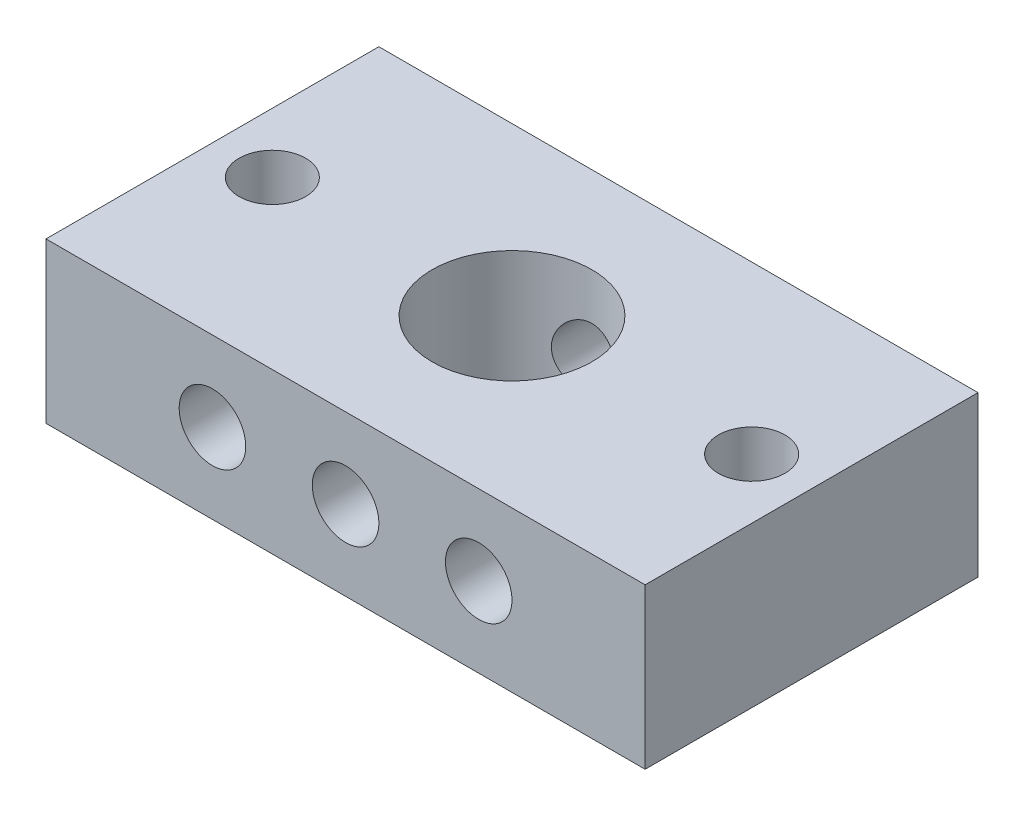
ISO-10303-21;
HEADER;
FILE_DESCRIPTION(('STEP AP214'),'2;1');
FILE_NAME('part.step','',(''),(''),'','','');
FILE_SCHEMA(('AUTOMOTIVE_DESIGN { 1 0 10303 214 1 1 1 1 }'));
ENDSEC;
DATA;
#1=APPLICATION_CONTEXT('core data for automotive mechanical design processes');
#2=APPLICATION_PROTOCOL_DEFINITION('international standard','automotive_design',2000,#1);
#3=PRODUCT_CONTEXT('',#1,'mechanical');
#4=PRODUCT('Part','Part','',(#3));
#5=PRODUCT_RELATED_PRODUCT_CATEGORY('part','',(#4));
#6=PRODUCT_DEFINITION_FORMATION('','',#4);
#7=PRODUCT_DEFINITION_CONTEXT('part definition',#1,'design');
#8=PRODUCT_DEFINITION('design','',#6,#7);
#9=PRODUCT_DEFINITION_SHAPE('','',#8);
#10=(LENGTH_UNIT() NAMED_UNIT(*) SI_UNIT(.MILLI.,.METRE.));
#11=(NAMED_UNIT(*) PLANE_ANGLE_UNIT() SI_UNIT($,.RADIAN.));
#12=(NAMED_UNIT(*) SI_UNIT($,.STERADIAN.) SOLID_ANGLE_UNIT());
#13=UNCERTAINTY_MEASURE_WITH_UNIT(LENGTH_MEASURE(1.E-05),#10,'distance_accuracy_value','');
#14=(GEOMETRIC_REPRESENTATION_CONTEXT(3) GLOBAL_UNCERTAINTY_ASSIGNED_CONTEXT((#13)) GLOBAL_UNIT_ASSIGNED_CONTEXT((#10,
#11,#12)) REPRESENTATION_CONTEXT('',''));
#15=CARTESIAN_POINT('',(0.,0.,0.));
#16=DIRECTION('',(0.,0.,1.));
#17=DIRECTION('',(1.,0.,0.));
#18=AXIS2_PLACEMENT_3D('',#15,#16,#17);
#19=CARTESIAN_POINT('',(0.,6.,59.5));
#20=DIRECTION('',(0.,0.,-1.));
#21=DIRECTION('',(-1.,0.,0.));
#22=AXIS2_PLACEMENT_3D('',#19,#20,#21);
#23=CYLINDRICAL_SURFACE('',#22,2.5);
#24=CARTESIAN_POINT('',(-2.5,6.,5.45435605731786));
#25=CARTESIAN_POINT('',(-2.49999850025921,6.0667081831549,5.45435734054166));
#26=CARTESIAN_POINT('',(-2.49732449538893,6.13343479216854,5.4555854329));
#27=CARTESIAN_POINT('',(-2.48666416485593,6.26638647840299,5.460451257595));
#28=CARTESIAN_POINT('',(-2.47867468210214,6.3326112338951,5.46409042196574));
#29=CARTESIAN_POINT('',(-2.44679265931592,6.53005186677056,5.47848490817198));
#30=CARTESIAN_POINT('',(-2.41498683408238,6.65983681642949,5.49271671920564));
#31=CARTESIAN_POINT('',(-2.33180001337599,6.91115476413125,5.52853615769555));
#32=CARTESIAN_POINT('',(-2.28049881438598,7.03271905209161,5.55009376241033));
#33=CARTESIAN_POINT('',(-2.16001268934738,7.26551017655699,5.59808356001864));
#34=CARTESIAN_POINT('',(-2.09083199376537,7.37673944997679,5.62451459938574));
#35=CARTESIAN_POINT('',(-1.93194778443699,7.59265398208942,5.68111508149861));
#36=CARTESIAN_POINT('',(-1.84130648149063,7.69661579704746,5.71141131571832));
#37=CARTESIAN_POINT('',(-1.64404334636732,7.88839976517447,5.77128595332677));
#38=CARTESIAN_POINT('',(-1.53741538134828,7.97621569551115,5.80086407614999));
#39=CARTESIAN_POINT('',(-1.30552678905513,8.13689925552864,5.8575107455344));
#40=CARTESIAN_POINT('',(-1.17965858775786,8.20895330788146,5.88441479600862));
#41=CARTESIAN_POINT('',(-0.916264044334339,8.33055198921748,5.93113040336416));
#42=CARTESIAN_POINT('',(-0.778742909642265,8.38010661039742,5.95094510785638));
#43=CARTESIAN_POINT('',(-0.503536996147008,8.45267893034036,5.98035041998162));
#44=CARTESIAN_POINT('',(-0.36623315241801,8.47694339323322,5.99041942231785));
#45=CARTESIAN_POINT('',(-0.089158360704174,8.50227527889198,6.00093657245546));
#46=CARTESIAN_POINT('',(0.050611563535766,8.50335211087422,6.00138862268061));
#47=CARTESIAN_POINT('',(0.319585560218813,8.48293143897079,5.99290258260449));
#48=CARTESIAN_POINT('',(0.448914977212893,8.46280379917312,5.98453429295767));
#49=CARTESIAN_POINT('',(0.702165787864647,8.40289379449909,5.96013033502178));
#50=CARTESIAN_POINT('',(0.826086782110447,8.36310998067885,5.94409410149732));
#51=CARTESIAN_POINT('',(1.06727623615443,8.26454391827247,5.90559704827471));
#52=CARTESIAN_POINT('',(1.18441435414909,8.20548107427576,5.88304194251414));
#53=CARTESIAN_POINT('',(1.40742353456465,8.0703084865819,5.83371427980366));
#54=CARTESIAN_POINT('',(1.51329059551623,7.99419271830215,5.80694023334947));
#55=CARTESIAN_POINT('',(1.7186818234134,7.8208351591992,5.74963397551513));
#56=CARTESIAN_POINT('',(1.81723287462318,7.72248241745696,5.71896988702082));
#57=CARTESIAN_POINT('',(1.99686282986464,7.51057711857186,5.65875721372882));
#58=CARTESIAN_POINT('',(2.0779349916834,7.39701872336434,5.62920906299902));
#59=CARTESIAN_POINT('',(2.22280378497075,7.15320992672028,5.57363224672088));
#60=CARTESIAN_POINT('',(2.28594506698397,7.0225335886945,5.54775116967603));
#61=CARTESIAN_POINT('',(2.38892864103959,6.75103791023743,5.50419688296718));
#62=CARTESIAN_POINT('',(2.42878759251238,6.61022590351575,5.48651780631503));
#63=CARTESIAN_POINT('',(2.48160050339178,6.33220638213301,5.46282425074792));
#64=CARTESIAN_POINT('',(2.49613229266517,6.19535775547148,5.45612738403682));
#65=CARTESIAN_POINT('',(2.50251261037213,5.92104303518741,5.45320573611839));
#66=CARTESIAN_POINT('',(2.49436898636095,5.78357717161926,5.45697733196184));
#67=CARTESIAN_POINT('',(2.45706955131303,5.5212032291366,5.47386262693795));
#68=CARTESIAN_POINT('',(2.42929237636148,5.39605462642581,5.48636276033852));
#69=CARTESIAN_POINT('',(2.355341171284,5.15229740700485,5.51851260594277));
#70=CARTESIAN_POINT('',(2.30916284106237,5.03369032633843,5.53816398920152));
#71=CARTESIAN_POINT('',(2.19755041610386,4.80076937928722,5.58341595714177));
#72=CARTESIAN_POINT('',(2.13138366612393,4.68685005078064,5.60923324404617));
#73=CARTESIAN_POINT('',(1.98240156877197,4.47118389500067,5.66360007481535));
#74=CARTESIAN_POINT('',(1.89957901575222,4.36944236659127,5.69215079841133));
#75=CARTESIAN_POINT('',(1.71168891143074,4.17239973023739,5.75157239569101));
#76=CARTESIAN_POINT('',(1.6053593229584,4.07829720011966,5.78244293417774));
#77=CARTESIAN_POINT('',(1.37770302510816,3.90905541602037,5.84086722367755));
#78=CARTESIAN_POINT('',(1.25637521761135,3.8339175517941,5.868420731537));
#79=CARTESIAN_POINT('',(1.00130936160273,3.70482024919155,5.91728503171628));
#80=CARTESIAN_POINT('',(0.867540339261896,3.65091551771517,5.93857966278875));
#81=CARTESIAN_POINT('',(0.591717670323946,3.56676641503718,5.9723634620551));
#82=CARTESIAN_POINT('',(0.449669008506775,3.536507962451,5.98485787035282));
#83=CARTESIAN_POINT('',(0.172033066960383,3.50228374997958,5.9990306959926));
#84=CARTESIAN_POINT('',(0.0366881693984344,3.49662800428995,6.0014040908376));
#85=CARTESIAN_POINT('',(-0.232973623239238,3.50722627890465,5.99699046946599));
#86=CARTESIAN_POINT('',(-0.367290694377476,3.52347645831395,5.99020505911644));
#87=CARTESIAN_POINT('',(-0.626172965578197,3.5762121575427,5.9686013201843));
#88=CARTESIAN_POINT('',(-0.750915078182086,3.61195940947576,5.95407648620171));
#89=CARTESIAN_POINT('',(-0.992584458507238,3.70186844587238,5.91858999492374));
#90=CARTESIAN_POINT('',(-1.1095102366691,3.75603372835824,5.89762711496349));
#91=CARTESIAN_POINT('',(-1.33804914068053,3.88397924757924,5.85011651583377));
#92=CARTESIAN_POINT('',(-1.44918335299799,3.95853532351305,5.82335921372399));
#93=CARTESIAN_POINT('',(-1.65783731421916,4.12401364481073,5.7674312075248));
#94=CARTESIAN_POINT('',(-1.75535198504112,4.21494196583612,5.73825960968076));
#95=CARTESIAN_POINT('',(-1.9408997224229,4.41789253007209,5.67829702479813));
#96=CARTESIAN_POINT('',(-2.02783607699356,4.53092911202995,5.64753091772368));
#97=CARTESIAN_POINT('',(-2.18166607575475,4.77090639200073,5.5899105903639));
#98=CARTESIAN_POINT('',(-2.24854851583746,4.89785480866736,5.56305856115973));
#99=CARTESIAN_POINT('',(-2.35965744264203,5.16192893335946,5.51685287460303));
#100=CARTESIAN_POINT('',(-2.40400437258696,5.29899595514957,5.49745949216625));
#101=CARTESIAN_POINT('',(-2.45239925350778,5.50916376906638,5.47594959049764));
#102=CARTESIAN_POINT('',(-2.46550603347808,5.57991059795605,5.47004503557757));
#103=CARTESIAN_POINT('',(-2.48558130943928,5.72242605641858,5.46095373466209));
#104=CARTESIAN_POINT('',(-2.49255414024397,5.79419392792262,5.45776506941946));
#105=CARTESIAN_POINT('',(-2.49880479670823,5.91071160563903,5.45490391727668));
#106=CARTESIAN_POINT('',(-2.50000100378859,5.9553516756734,5.45435519844583));
#107=CARTESIAN_POINT('',(-2.5,6.,5.45435605731786));
#108=B_SPLINE_CURVE_WITH_KNOTS('',3,(#24,#25,#26,#27,#28,#29,#30,#31,#32,#33,#34,#35,#36,#37,
#38,#39,#40,#41,#42,#43,#44,#45,#46,#47,#48,#49,#50,#51,#52,#53,#54,#55,#56,#57,#58,#59,#60,#61,
#62,#63,#64,#65,#66,#67,#68,#69,#70,#71,#72,#73,#74,#75,#76,#77,#78,#79,#80,#81,#82,#83,#84,#85,
#86,#87,#88,#89,#90,#91,#92,#93,#94,#95,#96,#97,#98,#99,#100,#101,#102,#103,#104,#105,#106,
#107),.UNSPECIFIED.,.T.,.F.,(4,2,2,2,2,2,2,2,2,2,2,2,2,2,2,2,2,2,2,2,2,2,2,2,2,2,2,2,2,2,2,2,2,
2,2,2,2,2,2,2,2,4),(0.,0.200084575093046,0.400288095243582,0.801278994956904,1.20064597557678,
1.59991854837275,2.02172149988563,2.44368668047077,2.88395420283103,3.32402600677038,
3.7411967908316,4.15819828963116,4.54982147617441,4.94147353531023,5.33910096407387,
5.73686909172223,6.16267530816224,6.58864548009989,7.02861558463919,7.46827048625634,
7.87940023747111,8.29038772171394,8.6750626926688,9.05982760961556,9.46088720770835,
9.86212068725427,10.2960179260552,10.7299469521823,11.1649867904569,11.5997673642051,
12.004157373226,12.4084764873833,12.7984529720747,13.1885035639884,13.5961819279257,
14.0040118923231,14.4395932095167,14.8754174341574,15.3088871873109,15.5252058174741,
15.7413714538654,15.8752896716763),.UNSPECIFIED.);
#109=CARTESIAN_POINT('',(-2.5,6.,5.45435605731786));
#110=VERTEX_POINT('',#109);
#111=EDGE_CURVE('E127',#110,#110,#108,.T.);
#112=ORIENTED_EDGE('',*,*,#111,.T.);
#113=EDGE_LOOP('',(#112));
#114=FACE_BOUND('',#113,.T.);
#115=CARTESIAN_POINT('',(0.,6.,12.5));
#116=DIRECTION('',(0.,0.,-1.));
#117=DIRECTION('',(-1.,0.,0.));
#118=AXIS2_PLACEMENT_3D('',#115,#116,#117);
#119=CIRCLE('',#118,2.5);
#120=CARTESIAN_POINT('',(-2.5,6.,12.5));
#121=VERTEX_POINT('',#120);
#122=EDGE_CURVE('E103',#121,#121,#119,.T.);
#123=ORIENTED_EDGE('',*,*,#122,.F.);
#124=EDGE_LOOP('',(#123));
#125=FACE_BOUND('',#124,.T.);
#126=ADVANCED_FACE('F33',(#114,#125),#23,.F.);
#127=CARTESIAN_POINT('',(22.5,12.,-12.5));
#128=DIRECTION('',(-1.,0.,0.));
#129=DIRECTION('',(0.,0.,1.));
#130=AXIS2_PLACEMENT_3D('',#127,#128,#129);
#131=PLANE('',#130);
#132=DIRECTION('',(0.,0.,-1.));
#133=VECTOR('',#132,1.);
#134=CARTESIAN_POINT('',(22.5,0.,-12.5));
#135=LINE('',#134,#133);
#136=CARTESIAN_POINT('',(22.5,0.,12.5));
#137=VERTEX_POINT('',#136);
#138=CARTESIAN_POINT('',(22.5,0.,-12.5));
#139=VERTEX_POINT('',#138);
#140=EDGE_CURVE('E100',#137,#139,#135,.T.);
#141=ORIENTED_EDGE('',*,*,#140,.T.);
#142=DIRECTION('',(0.,-1.,0.));
#143=VECTOR('',#142,1.);
#144=CARTESIAN_POINT('',(22.5,12.,-12.5));
#145=LINE('',#144,#143);
#146=CARTESIAN_POINT('',(22.5,12.,-12.5));
#147=VERTEX_POINT('',#146);
#148=EDGE_CURVE('E11',#147,#139,#145,.T.);
#149=ORIENTED_EDGE('',*,*,#148,.F.);
#150=DIRECTION('',(0.,0.,-1.));
#151=VECTOR('',#150,1.);
#152=CARTESIAN_POINT('',(22.5,12.,-12.5));
#153=LINE('',#152,#151);
#154=CARTESIAN_POINT('',(22.5,12.,12.5));
#155=VERTEX_POINT('',#154);
#156=EDGE_CURVE('E87',#155,#147,#153,.T.);
#157=ORIENTED_EDGE('',*,*,#156,.F.);
#158=DIRECTION('',(0.,-1.,0.));
#159=VECTOR('',#158,1.);
#160=CARTESIAN_POINT('',(22.5,12.,12.5));
#161=LINE('',#160,#159);
#162=EDGE_CURVE('E96',#155,#137,#161,.T.);
#163=ORIENTED_EDGE('',*,*,#162,.T.);
#164=EDGE_LOOP('',(#141,#149,#157,#163));
#165=FACE_BOUND('',#164,.T.);
#166=ADVANCED_FACE('F35',(#165),#131,.F.);
#167=CARTESIAN_POINT('',(-22.5,12.,-12.5));
#168=DIRECTION('',(0.,0.,1.));
#169=DIRECTION('',(1.,0.,0.));
#170=AXIS2_PLACEMENT_3D('',#167,#168,#169);
#171=PLANE('',#170);
#172=CARTESIAN_POINT('',(-10.,6.,-12.5));
#173=DIRECTION('',(0.,0.,-1.));
#174=DIRECTION('',(-1.,0.,0.));
#175=AXIS2_PLACEMENT_3D('',#172,#173,#174);
#176=CIRCLE('',#175,2.5);
#177=CARTESIAN_POINT('',(-12.5,6.,-12.5));
#178=VERTEX_POINT('',#177);
#179=EDGE_CURVE('E116',#178,#178,#176,.T.);
#180=ORIENTED_EDGE('',*,*,#179,.F.);
#181=EDGE_LOOP('',(#180));
#182=FACE_BOUND('',#181,.T.);
#183=CARTESIAN_POINT('',(10.,6.,-12.5));
#184=DIRECTION('',(0.,0.,-1.));
#185=DIRECTION('',(-1.,0.,0.));
#186=AXIS2_PLACEMENT_3D('',#183,#184,#185);
#187=CIRCLE('',#186,2.5);
#188=CARTESIAN_POINT('',(7.5,6.,-12.5));
#189=VERTEX_POINT('',#188);
#190=EDGE_CURVE('E190',#189,#189,#187,.T.);
#191=ORIENTED_EDGE('',*,*,#190,.F.);
#192=EDGE_LOOP('',(#191));
#193=FACE_BOUND('',#192,.T.);
#194=CARTESIAN_POINT('',(0.,6.,-12.5));
#195=DIRECTION('',(0.,0.,-1.));
#196=DIRECTION('',(-1.,0.,0.));
#197=AXIS2_PLACEMENT_3D('',#194,#195,#196);
#198=CIRCLE('',#197,2.5);
#199=CARTESIAN_POINT('',(-2.5,6.,-12.5));
#200=VERTEX_POINT('',#199);
#201=EDGE_CURVE('E111',#200,#200,#198,.T.);
#202=ORIENTED_EDGE('',*,*,#201,.F.);
#203=EDGE_LOOP('',(#202));
#204=FACE_BOUND('',#203,.T.);
#205=DIRECTION('',(-1.,0.,0.));
#206=VECTOR('',#205,1.);
#207=CARTESIAN_POINT('',(-22.5,0.,-12.5));
#208=LINE('',#207,#206);
#209=CARTESIAN_POINT('',(-22.5,0.,-12.5));
#210=VERTEX_POINT('',#209);
#211=EDGE_CURVE('E91',#139,#210,#208,.T.);
#212=ORIENTED_EDGE('',*,*,#211,.T.);
#213=DIRECTION('',(0.,-1.,0.));
#214=VECTOR('',#213,1.);
#215=CARTESIAN_POINT('',(-22.5,12.,-12.5));
#216=LINE('',#215,#214);
#217=CARTESIAN_POINT('',(-22.5,12.,-12.5));
#218=VERTEX_POINT('',#217);
#219=EDGE_CURVE('E43',#218,#210,#216,.T.);
#220=ORIENTED_EDGE('',*,*,#219,.F.);
#221=DIRECTION('',(-1.,0.,0.));
#222=VECTOR('',#221,1.);
#223=CARTESIAN_POINT('',(-22.5,12.,-12.5));
#224=LINE('',#223,#222);
#225=EDGE_CURVE('E82',#147,#218,#224,.T.);
#226=ORIENTED_EDGE('',*,*,#225,.F.);
#227=ORIENTED_EDGE('',*,*,#148,.T.);
#228=EDGE_LOOP('',(#212,#220,#226,#227));
#229=FACE_BOUND('',#228,.T.);
#230=ADVANCED_FACE('F90',(#182,#193,#204,#229),#171,.F.);
#231=CARTESIAN_POINT('',(-22.5,12.,-12.5));
#232=DIRECTION('',(1.,0.,0.));
#233=DIRECTION('',(0.,0.,-1.));
#234=AXIS2_PLACEMENT_3D('',#231,#232,#233);
#235=PLANE('',#234);
#236=DIRECTION('',(0.,0.,1.));
#237=VECTOR('',#236,1.);
#238=CARTESIAN_POINT('',(-22.5,0.,-12.5));
#239=LINE('',#238,#237);
#240=CARTESIAN_POINT('',(-22.5,0.,12.5));
#241=VERTEX_POINT('',#240);
#242=EDGE_CURVE('E69',#210,#241,#239,.T.);
#243=ORIENTED_EDGE('',*,*,#242,.T.);
#244=DIRECTION('',(0.,-1.,0.));
#245=VECTOR('',#244,1.);
#246=CARTESIAN_POINT('',(-22.5,12.,12.5));
#247=LINE('',#246,#245);
#248=CARTESIAN_POINT('',(-22.5,12.,12.5));
#249=VERTEX_POINT('',#248);
#250=EDGE_CURVE('E92',#249,#241,#247,.T.);
#251=ORIENTED_EDGE('',*,*,#250,.F.);
#252=DIRECTION('',(0.,0.,1.));
#253=VECTOR('',#252,1.);
#254=CARTESIAN_POINT('',(-22.5,12.,-12.5));
#255=LINE('',#254,#253);
#256=EDGE_CURVE('E85',#218,#249,#255,.T.);
#257=ORIENTED_EDGE('',*,*,#256,.F.);
#258=ORIENTED_EDGE('',*,*,#219,.T.);
#259=EDGE_LOOP('',(#243,#251,#257,#258));
#260=FACE_BOUND('',#259,.T.);
#261=ADVANCED_FACE('F94',(#260),#235,.F.);
#262=CARTESIAN_POINT('',(-22.5,12.,12.5));
#263=DIRECTION('',(0.,0.,-1.));
#264=DIRECTION('',(-1.,0.,0.));
#265=AXIS2_PLACEMENT_3D('',#262,#263,#264);
#266=PLANE('',#265);
#267=CARTESIAN_POINT('',(-10.,6.,12.5));
#268=DIRECTION('',(0.,0.,-1.));
#269=DIRECTION('',(-1.,0.,0.));
#270=AXIS2_PLACEMENT_3D('',#267,#268,#269);
#271=CIRCLE('',#270,2.5);
#272=CARTESIAN_POINT('',(-12.5,6.,12.5));
#273=VERTEX_POINT('',#272);
#274=EDGE_CURVE('E115',#273,#273,#271,.T.);
#275=ORIENTED_EDGE('',*,*,#274,.T.);
#276=EDGE_LOOP('',(#275));
#277=FACE_BOUND('',#276,.T.);
#278=CARTESIAN_POINT('',(10.,6.,12.5));
#279=DIRECTION('',(0.,0.,-1.));
#280=DIRECTION('',(-1.,0.,0.));
#281=AXIS2_PLACEMENT_3D('',#278,#279,#280);
#282=CIRCLE('',#281,2.5);
#283=CARTESIAN_POINT('',(7.5,6.,12.5));
#284=VERTEX_POINT('',#283);
#285=EDGE_CURVE('E112',#284,#284,#282,.T.);
#286=ORIENTED_EDGE('',*,*,#285,.T.);
#287=EDGE_LOOP('',(#286));
#288=FACE_BOUND('',#287,.T.);
#289=ORIENTED_EDGE('',*,*,#122,.T.);
#290=EDGE_LOOP('',(#289));
#291=FACE_BOUND('',#290,.T.);
#292=DIRECTION('',(1.,0.,0.));
#293=VECTOR('',#292,1.);
#294=CARTESIAN_POINT('',(-22.5,0.,12.5));
#295=LINE('',#294,#293);
#296=EDGE_CURVE('E75',#241,#137,#295,.T.);
#297=ORIENTED_EDGE('',*,*,#296,.T.);
#298=ORIENTED_EDGE('',*,*,#162,.F.);
#299=DIRECTION('',(1.,0.,0.));
#300=VECTOR('',#299,1.);
#301=CARTESIAN_POINT('',(-22.5,12.,12.5));
#302=LINE('',#301,#300);
#303=EDGE_CURVE('E52',#249,#155,#302,.T.);
#304=ORIENTED_EDGE('',*,*,#303,.F.);
#305=ORIENTED_EDGE('',*,*,#250,.T.);
#306=EDGE_LOOP('',(#297,#298,#304,#305));
#307=FACE_BOUND('',#306,.T.);
#308=ADVANCED_FACE('F169',(#277,#288,#291,#307),#266,.F.);
#309=CARTESIAN_POINT('',(0.,12.,0.));
#310=DIRECTION('',(0.,1.,0.));
#311=DIRECTION('',(0.,0.,1.));
#312=AXIS2_PLACEMENT_3D('',#309,#310,#311);
#313=PLANE('',#312);
#314=CARTESIAN_POINT('',(-18.,12.,0.));
#315=DIRECTION('',(0.,1.,0.));
#316=DIRECTION('',(0.,0.,1.));
#317=AXIS2_PLACEMENT_3D('',#314,#315,#316);
#318=CIRCLE('',#317,2.5);
#319=CARTESIAN_POINT('',(-18.,12.,2.5));
#320=VERTEX_POINT('',#319);
#321=EDGE_CURVE('E206',#320,#320,#318,.T.);
#322=ORIENTED_EDGE('',*,*,#321,.F.);
#323=EDGE_LOOP('',(#322));
#324=FACE_BOUND('',#323,.T.);
#325=CARTESIAN_POINT('',(18.,12.,0.));
#326=DIRECTION('',(0.,1.,0.));
#327=DIRECTION('',(0.,0.,1.));
#328=AXIS2_PLACEMENT_3D('',#325,#326,#327);
#329=CIRCLE('',#328,2.5);
#330=CARTESIAN_POINT('',(18.,12.,2.5));
#331=VERTEX_POINT('',#330);
#332=EDGE_CURVE('E203',#331,#331,#329,.T.);
#333=ORIENTED_EDGE('',*,*,#332,.F.);
#334=EDGE_LOOP('',(#333));
#335=FACE_BOUND('',#334,.T.);
#336=CARTESIAN_POINT('',(0.,12.,0.));
#337=DIRECTION('',(0.,1.,0.));
#338=DIRECTION('',(0.,0.,1.));
#339=AXIS2_PLACEMENT_3D('',#336,#337,#338);
#340=CIRCLE('',#339,6.);
#341=CARTESIAN_POINT('',(0.,12.,6.));
#342=VERTEX_POINT('',#341);
#343=EDGE_CURVE('E128',#342,#342,#340,.T.);
#344=ORIENTED_EDGE('',*,*,#343,.F.);
#345=EDGE_LOOP('',(#344));
#346=FACE_BOUND('',#345,.T.);
#347=ORIENTED_EDGE('',*,*,#156,.T.);
#348=ORIENTED_EDGE('',*,*,#225,.T.);
#349=ORIENTED_EDGE('',*,*,#256,.T.);
#350=ORIENTED_EDGE('',*,*,#303,.T.);
#351=EDGE_LOOP('',(#347,#348,#349,#350));
#352=FACE_BOUND('',#351,.T.);
#353=ADVANCED_FACE('F83',(#324,#335,#346,#352),#313,.T.);
#354=CARTESIAN_POINT('',(0.,0.,0.));
#355=DIRECTION('',(0.,1.,0.));
#356=DIRECTION('',(0.,0.,1.));
#357=AXIS2_PLACEMENT_3D('',#354,#355,#356);
#358=PLANE('',#357);
#359=CARTESIAN_POINT('',(-18.,0.,0.));
#360=DIRECTION('',(0.,1.,0.));
#361=DIRECTION('',(0.,0.,1.));
#362=AXIS2_PLACEMENT_3D('',#359,#360,#361);
#363=CIRCLE('',#362,2.5);
#364=CARTESIAN_POINT('',(-18.,0.,2.5));
#365=VERTEX_POINT('',#364);
#366=EDGE_CURVE('E37',#365,#365,#363,.T.);
#367=ORIENTED_EDGE('',*,*,#366,.T.);
#368=EDGE_LOOP('',(#367));
#369=FACE_BOUND('',#368,.T.);
#370=CARTESIAN_POINT('',(18.,0.,0.));
#371=DIRECTION('',(0.,1.,0.));
#372=DIRECTION('',(0.,0.,1.));
#373=AXIS2_PLACEMENT_3D('',#370,#371,#372);
#374=CIRCLE('',#373,2.5);
#375=CARTESIAN_POINT('',(18.,0.,2.5));
#376=VERTEX_POINT('',#375);
#377=EDGE_CURVE('E208',#376,#376,#374,.T.);
#378=ORIENTED_EDGE('',*,*,#377,.T.);
#379=EDGE_LOOP('',(#378));
#380=FACE_BOUND('',#379,.T.);
#381=CARTESIAN_POINT('',(0.,0.,0.));
#382=DIRECTION('',(0.,1.,0.));
#383=DIRECTION('',(0.,0.,1.));
#384=AXIS2_PLACEMENT_3D('',#381,#382,#383);
#385=CIRCLE('',#384,6.);
#386=CARTESIAN_POINT('',(0.,0.,6.));
#387=VERTEX_POINT('',#386);
#388=EDGE_CURVE('E197',#387,#387,#385,.T.);
#389=ORIENTED_EDGE('',*,*,#388,.T.);
#390=EDGE_LOOP('',(#389));
#391=FACE_BOUND('',#390,.T.);
#392=ORIENTED_EDGE('',*,*,#140,.F.);
#393=ORIENTED_EDGE('',*,*,#296,.F.);
#394=ORIENTED_EDGE('',*,*,#242,.F.);
#395=ORIENTED_EDGE('',*,*,#211,.F.);
#396=EDGE_LOOP('',(#392,#393,#394,#395));
#397=FACE_BOUND('',#396,.T.);
#398=ADVANCED_FACE('F154',(#369,#380,#391,#397),#358,.F.);
#399=CARTESIAN_POINT('',(-2.5,6.,-5.45435605731786));
#400=CARTESIAN_POINT('',(-2.49999850025921,5.9332918168451,-5.45435734054166));
#401=CARTESIAN_POINT('',(-2.49732449538893,5.86656520783146,-5.4555854329));
#402=CARTESIAN_POINT('',(-2.48666416485593,5.73361352159701,-5.460451257595));
#403=CARTESIAN_POINT('',(-2.47867468210214,5.6673887661049,-5.46409042196574));
#404=CARTESIAN_POINT('',(-2.44679265931592,5.46994813322944,-5.47848490817198));
#405=CARTESIAN_POINT('',(-2.41498683408238,5.34016318357051,-5.49271671920564));
#406=CARTESIAN_POINT('',(-2.33180001337599,5.08884523586874,-5.52853615769555));
#407=CARTESIAN_POINT('',(-2.28049881438598,4.96728094790839,-5.55009376241033));
#408=CARTESIAN_POINT('',(-2.16001268934738,4.73448982344301,-5.59808356001865));
#409=CARTESIAN_POINT('',(-2.09083199376537,4.62326055002321,-5.62451459938574));
#410=CARTESIAN_POINT('',(-1.93194778443699,4.40734601791058,-5.68111508149861));
#411=CARTESIAN_POINT('',(-1.84130648149063,4.30338420295254,-5.71141131571833));
#412=CARTESIAN_POINT('',(-1.64404334636732,4.11160023482553,-5.77128595332677));
#413=CARTESIAN_POINT('',(-1.53741538134828,4.02378430448885,-5.80086407614999));
#414=CARTESIAN_POINT('',(-1.30552678905513,3.86310074447136,-5.8575107455344));
#415=CARTESIAN_POINT('',(-1.17965858775786,3.79104669211854,-5.88441479600862));
#416=CARTESIAN_POINT('',(-0.916264044334339,3.66944801078252,-5.93113040336416));
#417=CARTESIAN_POINT('',(-0.778742909642264,3.61989338960258,-5.95094510785638));
#418=CARTESIAN_POINT('',(-0.503536996147007,3.54732106965964,-5.98035041998162));
#419=CARTESIAN_POINT('',(-0.366233152418009,3.52305660676678,-5.99041942231785));
#420=CARTESIAN_POINT('',(-0.0891583607041735,3.49772472110802,-6.00093657245546));
#421=CARTESIAN_POINT('',(0.0506115635357663,3.49664788912577,-6.00138862268061));
#422=CARTESIAN_POINT('',(0.319585560218813,3.51706856102921,-5.99290258260449));
#423=CARTESIAN_POINT('',(0.448914977212893,3.53719620082688,-5.98453429295767));
#424=CARTESIAN_POINT('',(0.702165787864647,3.59710620550091,-5.96013033502178));
#425=CARTESIAN_POINT('',(0.826086782110447,3.63689001932115,-5.94409410149732));
#426=CARTESIAN_POINT('',(1.06727623615443,3.73545608172753,-5.90559704827471));
#427=CARTESIAN_POINT('',(1.18441435414909,3.79451892572424,-5.88304194251414));
#428=CARTESIAN_POINT('',(1.40742353456466,3.9296915134181,-5.83371427980366));
#429=CARTESIAN_POINT('',(1.51329059551624,4.00580728169785,-5.80694023334947));
#430=CARTESIAN_POINT('',(1.7186818234134,4.1791648408008,-5.74963397551513));
#431=CARTESIAN_POINT('',(1.81723287462318,4.27751758254304,-5.71896988702082));
#432=CARTESIAN_POINT('',(1.99686282986464,4.48942288142814,-5.65875721372882));
#433=CARTESIAN_POINT('',(2.0779349916834,4.60298127663566,-5.62920906299901));
#434=CARTESIAN_POINT('',(2.22280378497075,4.84679007327972,-5.57363224672088));
#435=CARTESIAN_POINT('',(2.28594506698397,4.9774664113055,-5.54775116967603));
#436=CARTESIAN_POINT('',(2.38892864103959,5.24896208976257,-5.50419688296718));
#437=CARTESIAN_POINT('',(2.42878759251237,5.38977409648425,-5.48651780631503));
#438=CARTESIAN_POINT('',(2.48160050339178,5.66779361786699,-5.46282425074792));
#439=CARTESIAN_POINT('',(2.49613229266517,5.80464224452852,-5.45612738403682));
#440=CARTESIAN_POINT('',(2.50251261037213,6.07895696481259,-5.45320573611839));
#441=CARTESIAN_POINT('',(2.49436898636095,6.21642282838074,-5.45697733196184));
#442=CARTESIAN_POINT('',(2.45706955131303,6.4787967708634,-5.47386262693795));
#443=CARTESIAN_POINT('',(2.42929237636148,6.60394537357419,-5.48636276033852));
#444=CARTESIAN_POINT('',(2.355341171284,6.84770259299515,-5.51851260594277));
#445=CARTESIAN_POINT('',(2.30916284106237,6.96630967366157,-5.53816398920152));
#446=CARTESIAN_POINT('',(2.19755041610386,7.19923062071278,-5.58341595714177));
#447=CARTESIAN_POINT('',(2.13138366612393,7.31314994921936,-5.60923324404617));
#448=CARTESIAN_POINT('',(1.98240156877197,7.52881610499933,-5.66360007481535));
#449=CARTESIAN_POINT('',(1.89957901575222,7.63055763340873,-5.69215079841133));
#450=CARTESIAN_POINT('',(1.71168891143075,7.82760026976261,-5.75157239569101));
#451=CARTESIAN_POINT('',(1.6053593229584,7.92170279988034,-5.78244293417774));
#452=CARTESIAN_POINT('',(1.37770302510816,8.09094458397963,-5.84086722367755));
#453=CARTESIAN_POINT('',(1.25637521761135,8.1660824482059,-5.868420731537));
#454=CARTESIAN_POINT('',(1.00130936160273,8.29517975080845,-5.91728503171628));
#455=CARTESIAN_POINT('',(0.867540339261895,8.34908448228483,-5.93857966278875));
#456=CARTESIAN_POINT('',(0.591717670323945,8.43323358496282,-5.9723634620551));
#457=CARTESIAN_POINT('',(0.449669008506774,8.463492037549,-5.98485787035282));
#458=CARTESIAN_POINT('',(0.172033066960382,8.49771625002042,-5.9990306959926));
#459=CARTESIAN_POINT('',(0.0366881693984328,8.50337199571005,-6.0014040908376));
#460=CARTESIAN_POINT('',(-0.232973623239239,8.49277372109535,-5.99699046946599));
#461=CARTESIAN_POINT('',(-0.367290694377477,8.47652354168605,-5.99020505911644));
#462=CARTESIAN_POINT('',(-0.626172965578197,8.4237878424573,-5.9686013201843));
#463=CARTESIAN_POINT('',(-0.750915078182086,8.38804059052424,-5.95407648620171));
#464=CARTESIAN_POINT('',(-0.992584458507238,8.29813155412762,-5.91858999492374));
#465=CARTESIAN_POINT('',(-1.1095102366691,8.24396627164176,-5.89762711496349));
#466=CARTESIAN_POINT('',(-1.33804914068053,8.11602075242076,-5.85011651583377));
#467=CARTESIAN_POINT('',(-1.44918335299799,8.04146467648695,-5.82335921372399));
#468=CARTESIAN_POINT('',(-1.65783731421916,7.87598635518927,-5.7674312075248));
#469=CARTESIAN_POINT('',(-1.75535198504112,7.78505803416388,-5.73825960968076));
#470=CARTESIAN_POINT('',(-1.9408997224229,7.58210746992791,-5.67829702479813));
#471=CARTESIAN_POINT('',(-2.02783607699356,7.46907088797005,-5.64753091772368));
#472=CARTESIAN_POINT('',(-2.18166607575475,7.22909360799927,-5.5899105903639));
#473=CARTESIAN_POINT('',(-2.24854851583746,7.10214519133264,-5.56305856115973));
#474=CARTESIAN_POINT('',(-2.35965744264203,6.83807106664054,-5.51685287460303));
#475=CARTESIAN_POINT('',(-2.40400437258696,6.70100404485043,-5.49745949216625));
#476=CARTESIAN_POINT('',(-2.45239925350778,6.49083623093362,-5.47594959049764));
#477=CARTESIAN_POINT('',(-2.46550603347808,6.42008940204395,-5.47004503557757));
#478=CARTESIAN_POINT('',(-2.48558130943928,6.27757394358142,-5.46095373466209));
#479=CARTESIAN_POINT('',(-2.49255414024397,6.20580607207738,-5.45776506941946));
#480=CARTESIAN_POINT('',(-2.49880479670823,6.08928839436097,-5.45490391727668));
#481=CARTESIAN_POINT('',(-2.50000100378859,6.0446483243266,-5.45435519844583));
#482=CARTESIAN_POINT('',(-2.5,6.,-5.45435605731786));
#483=B_SPLINE_CURVE_WITH_KNOTS('',3,(#399,#400,#401,#402,#403,#404,#405,#406,#407,#408,#409,
#410,#411,#412,#413,#414,#415,#416,#417,#418,#419,#420,#421,#422,#423,#424,#425,#426,#427,#428,
#429,#430,#431,#432,#433,#434,#435,#436,#437,#438,#439,#440,#441,#442,#443,#444,#445,#446,#447,
#448,#449,#450,#451,#452,#453,#454,#455,#456,#457,#458,#459,#460,#461,#462,#463,#464,#465,#466,
#467,#468,#469,#470,#471,#472,#473,#474,#475,#476,#477,#478,#479,#480,#481,#482),.UNSPECIFIED.,
.T.,.F.,(4,2,2,2,2,2,2,2,2,2,2,2,2,2,2,2,2,2,2,2,2,2,2,2,2,2,2,2,2,2,2,2,2,2,2,2,2,2,2,2,2,4),
(0.,0.200084575093046,0.400288095243582,0.801278994956904,1.20064597557678,1.59991854837275,
2.02172149988563,2.44368668047076,2.88395420283103,3.32402600677038,3.7411967908316,
4.15819828963116,4.54982147617441,4.94147353531023,5.33910096407387,5.73686909172223,
6.16267530816224,6.58864548009989,7.02861558463919,7.46827048625634,7.87940023747111,
8.29038772171394,8.6750626926688,9.05982760961556,9.46088720770835,9.86212068725427,
10.2960179260552,10.7299469521823,11.1649867904569,11.5997673642051,12.004157373226,
12.4084764873833,12.7984529720747,13.1885035639884,13.5961819279257,14.0040118923231,
14.4395932095167,14.8754174341574,15.3088871873109,15.5252058174741,15.7413714538654,
15.8752896716763),.UNSPECIFIED.);
#484=CARTESIAN_POINT('',(-2.5,6.,-5.45435605731786));
#485=VERTEX_POINT('',#484);
#486=EDGE_CURVE('E119',#485,#485,#483,.T.);
#487=ORIENTED_EDGE('',*,*,#486,.T.);
#488=EDGE_LOOP('',(#487));
#489=FACE_BOUND('',#488,.T.);
#490=ORIENTED_EDGE('',*,*,#201,.T.);
#491=EDGE_LOOP('',(#490));
#492=FACE_BOUND('',#491,.T.);
#493=ADVANCED_FACE('F132',(#489,#492),#23,.F.);
#494=CARTESIAN_POINT('',(10.,6.,59.5));
#495=DIRECTION('',(0.,0.,-1.));
#496=DIRECTION('',(-1.,0.,0.));
#497=AXIS2_PLACEMENT_3D('',#494,#495,#496);
#498=CYLINDRICAL_SURFACE('',#497,2.5);
#499=ORIENTED_EDGE('',*,*,#190,.T.);
#500=EDGE_LOOP('',(#499));
#501=FACE_BOUND('',#500,.T.);
#502=ORIENTED_EDGE('',*,*,#285,.F.);
#503=EDGE_LOOP('',(#502));
#504=FACE_BOUND('',#503,.T.);
#505=ADVANCED_FACE('F147',(#501,#504),#498,.F.);
#506=CARTESIAN_POINT('',(-10.,6.,59.5));
#507=DIRECTION('',(0.,0.,-1.));
#508=DIRECTION('',(-1.,0.,0.));
#509=AXIS2_PLACEMENT_3D('',#506,#507,#508);
#510=CYLINDRICAL_SURFACE('',#509,2.5);
#511=ORIENTED_EDGE('',*,*,#179,.T.);
#512=EDGE_LOOP('',(#511));
#513=FACE_BOUND('',#512,.T.);
#514=ORIENTED_EDGE('',*,*,#274,.F.);
#515=EDGE_LOOP('',(#514));
#516=FACE_BOUND('',#515,.T.);
#517=ADVANCED_FACE('F142',(#513,#516),#510,.F.);
#518=CARTESIAN_POINT('',(0.,-60.,0.));
#519=DIRECTION('',(0.,1.,0.));
#520=DIRECTION('',(0.,0.,1.));
#521=AXIS2_PLACEMENT_3D('',#518,#519,#520);
#522=CYLINDRICAL_SURFACE('',#521,6.);
#523=ORIENTED_EDGE('',*,*,#111,.F.);
#524=EDGE_LOOP('',(#523));
#525=FACE_BOUND('',#524,.T.);
#526=ORIENTED_EDGE('',*,*,#343,.T.);
#527=EDGE_LOOP('',(#526));
#528=FACE_BOUND('',#527,.T.);
#529=ORIENTED_EDGE('',*,*,#486,.F.);
#530=EDGE_LOOP('',(#529));
#531=FACE_BOUND('',#530,.T.);
#532=ORIENTED_EDGE('',*,*,#388,.F.);
#533=EDGE_LOOP('',(#532));
#534=FACE_BOUND('',#533,.T.);
#535=ADVANCED_FACE('F136',(#525,#528,#531,#534),#522,.F.);
#536=CARTESIAN_POINT('',(18.,-60.,0.));
#537=DIRECTION('',(0.,1.,0.));
#538=DIRECTION('',(0.,0.,1.));
#539=AXIS2_PLACEMENT_3D('',#536,#537,#538);
#540=CYLINDRICAL_SURFACE('',#539,2.5);
#541=ORIENTED_EDGE('',*,*,#332,.T.);
#542=EDGE_LOOP('',(#541));
#543=FACE_BOUND('',#542,.T.);
#544=ORIENTED_EDGE('',*,*,#377,.F.);
#545=EDGE_LOOP('',(#544));
#546=FACE_BOUND('',#545,.T.);
#547=ADVANCED_FACE('F141',(#543,#546),#540,.F.);
#548=CARTESIAN_POINT('',(-18.,-60.,0.));
#549=DIRECTION('',(0.,1.,0.));
#550=DIRECTION('',(0.,0.,1.));
#551=AXIS2_PLACEMENT_3D('',#548,#549,#550);
#552=CYLINDRICAL_SURFACE('',#551,2.5);
#553=ORIENTED_EDGE('',*,*,#321,.T.);
#554=EDGE_LOOP('',(#553));
#555=FACE_BOUND('',#554,.T.);
#556=ORIENTED_EDGE('',*,*,#366,.F.);
#557=EDGE_LOOP('',(#556));
#558=FACE_BOUND('',#557,.T.);
#559=ADVANCED_FACE('F218',(#555,#558),#552,.F.);
#560=CLOSED_SHELL('',(#126,#166,#230,#261,#308,#353,#398,#493,#505,#517,#535,#547,#559));
#561=MANIFOLD_SOLID_BREP('B2',#560);
#562=ADVANCED_BREP_SHAPE_REPRESENTATION('',(#18,#561),#14);
#563=SHAPE_DEFINITION_REPRESENTATION(#9,#562);
ENDSEC;
END-ISO-10303-21;
